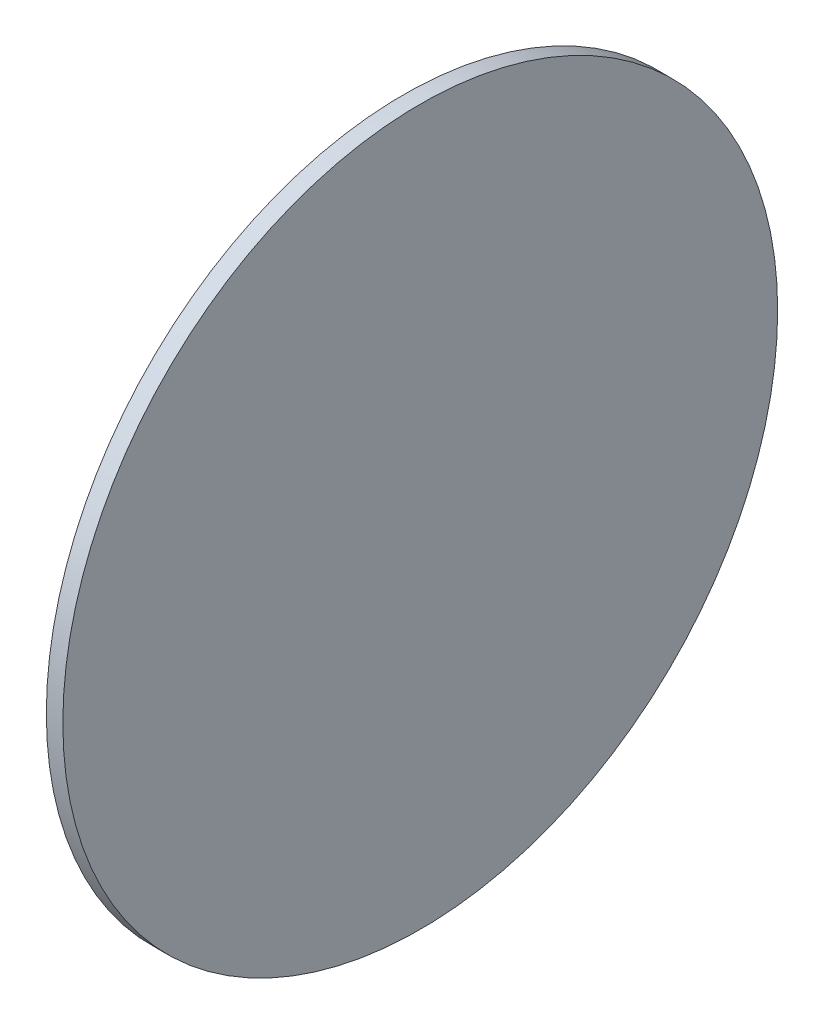
ISO-10303-21;
HEADER;
FILE_DESCRIPTION(('STEP AP214'),'2;1');
FILE_NAME('part.step','',(''),(''),'','','');
FILE_SCHEMA(('AUTOMOTIVE_DESIGN { 1 0 10303 214 1 1 1 1 }'));
ENDSEC;
DATA;
#1=APPLICATION_CONTEXT('core data for automotive mechanical design processes');
#2=APPLICATION_PROTOCOL_DEFINITION('international standard','automotive_design',2000,#1);
#3=PRODUCT_CONTEXT('',#1,'mechanical');
#4=PRODUCT('Part','Part','',(#3));
#5=PRODUCT_RELATED_PRODUCT_CATEGORY('part','',(#4));
#6=PRODUCT_DEFINITION_FORMATION('','',#4);
#7=PRODUCT_DEFINITION_CONTEXT('part definition',#1,'design');
#8=PRODUCT_DEFINITION('design','',#6,#7);
#9=PRODUCT_DEFINITION_SHAPE('','',#8);
#10=(LENGTH_UNIT() NAMED_UNIT(*) SI_UNIT(.MILLI.,.METRE.));
#11=(NAMED_UNIT(*) PLANE_ANGLE_UNIT() SI_UNIT($,.RADIAN.));
#12=(NAMED_UNIT(*) SI_UNIT($,.STERADIAN.) SOLID_ANGLE_UNIT());
#13=UNCERTAINTY_MEASURE_WITH_UNIT(LENGTH_MEASURE(1.E-05),#10,'distance_accuracy_value','');
#14=(GEOMETRIC_REPRESENTATION_CONTEXT(3) GLOBAL_UNCERTAINTY_ASSIGNED_CONTEXT((#13)) GLOBAL_UNIT_ASSIGNED_CONTEXT((#10,
#11,#12)) REPRESENTATION_CONTEXT('',''));
#15=CARTESIAN_POINT('',(0.,0.,0.));
#16=DIRECTION('',(0.,0.,1.));
#17=DIRECTION('',(1.,0.,0.));
#18=AXIS2_PLACEMENT_3D('',#15,#16,#17);
#19=CARTESIAN_POINT('',(3.,0.,0.));
#20=DIRECTION('',(-1.,0.,0.));
#21=DIRECTION('',(0.,0.,1.));
#22=AXIS2_PLACEMENT_3D('',#19,#20,#21);
#23=CYLINDRICAL_SURFACE('',#22,64.9999999999986);
#24=CARTESIAN_POINT('',(3.,0.,0.));
#25=DIRECTION('',(-1.,0.,0.));
#26=DIRECTION('',(0.,0.,1.));
#27=AXIS2_PLACEMENT_3D('',#24,#25,#26);
#28=CIRCLE('',#27,64.9999999999986);
#29=CARTESIAN_POINT('',(3.,0.,64.9999999999986));
#30=VERTEX_POINT('',#29);
#31=EDGE_CURVE('E10',#30,#30,#28,.T.);
#32=ORIENTED_EDGE('',*,*,#31,.T.);
#33=EDGE_LOOP('',(#32));
#34=FACE_BOUND('',#33,.T.);
#35=CARTESIAN_POINT('',(0.,0.,0.));
#36=DIRECTION('',(-1.,0.,0.));
#37=DIRECTION('',(0.,0.,1.));
#38=AXIS2_PLACEMENT_3D('',#35,#36,#37);
#39=CIRCLE('',#38,64.9999999999986);
#40=CARTESIAN_POINT('',(0.,0.,64.9999999999986));
#41=VERTEX_POINT('',#40);
#42=EDGE_CURVE('E36',#41,#41,#39,.T.);
#43=ORIENTED_EDGE('',*,*,#42,.F.);
#44=EDGE_LOOP('',(#43));
#45=FACE_BOUND('',#44,.T.);
#46=ADVANCED_FACE('F33',(#34,#45),#23,.T.);
#47=CARTESIAN_POINT('',(3.,0.,0.));
#48=DIRECTION('',(-1.,0.,0.));
#49=DIRECTION('',(0.,0.,1.));
#50=AXIS2_PLACEMENT_3D('',#47,#48,#49);
#51=PLANE('',#50);
#52=ORIENTED_EDGE('',*,*,#31,.F.);
#53=EDGE_LOOP('',(#52));
#54=FACE_BOUND('',#53,.T.);
#55=ADVANCED_FACE('F48',(#54),#51,.F.);
#56=CARTESIAN_POINT('',(0.,0.,0.));
#57=DIRECTION('',(-1.,0.,0.));
#58=DIRECTION('',(0.,0.,1.));
#59=AXIS2_PLACEMENT_3D('',#56,#57,#58);
#60=PLANE('',#59);
#61=ORIENTED_EDGE('',*,*,#42,.T.);
#62=EDGE_LOOP('',(#61));
#63=FACE_BOUND('',#62,.T.);
#64=ADVANCED_FACE('F45',(#63),#60,.T.);
#65=CLOSED_SHELL('',(#46,#55,#64));
#66=MANIFOLD_SOLID_BREP('B2',#65);
#67=ADVANCED_BREP_SHAPE_REPRESENTATION('',(#18,#66),#14);
#68=SHAPE_DEFINITION_REPRESENTATION(#9,#67);
ENDSEC;
END-ISO-10303-21;
